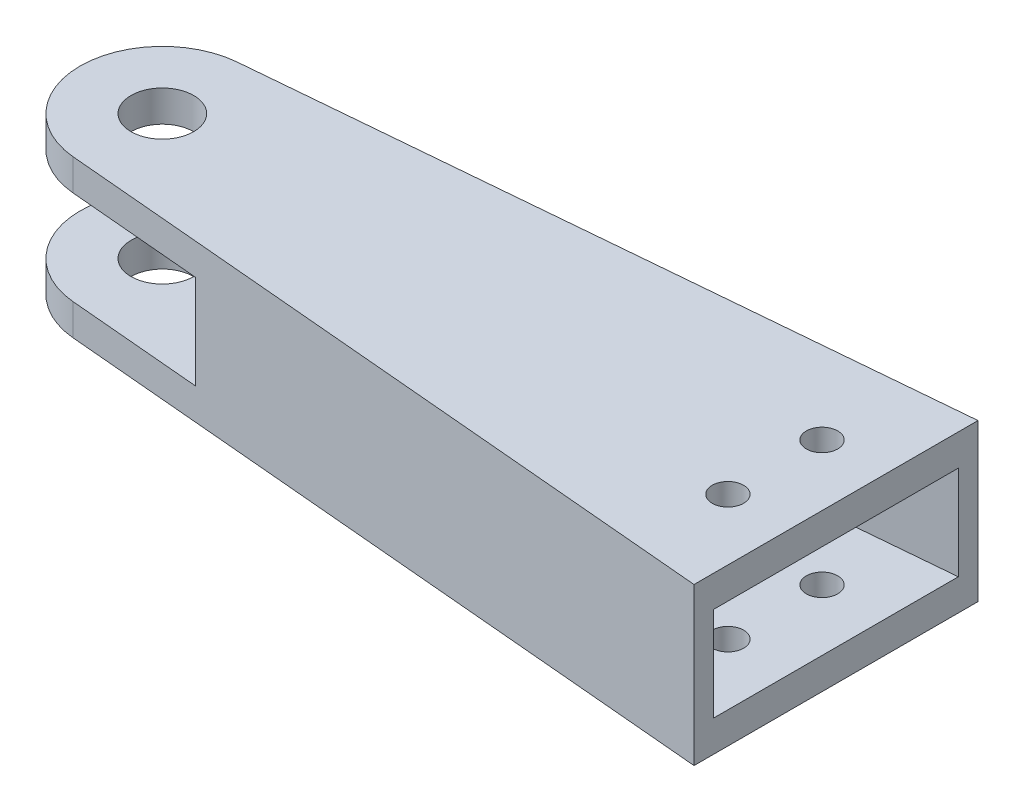
ISO-10303-21;
HEADER;
FILE_DESCRIPTION(('STEP AP214'),'2;1');
FILE_NAME('part.step','',(''),(''),'','','');
FILE_SCHEMA(('AUTOMOTIVE_DESIGN { 1 0 10303 214 1 1 1 1 }'));
ENDSEC;
DATA;
#1=APPLICATION_CONTEXT('core data for automotive mechanical design processes');
#2=APPLICATION_PROTOCOL_DEFINITION('international standard','automotive_design',2000,#1);
#3=PRODUCT_CONTEXT('',#1,'mechanical');
#4=PRODUCT('Part','Part','',(#3));
#5=PRODUCT_RELATED_PRODUCT_CATEGORY('part','',(#4));
#6=PRODUCT_DEFINITION_FORMATION('','',#4);
#7=PRODUCT_DEFINITION_CONTEXT('part definition',#1,'design');
#8=PRODUCT_DEFINITION('design','',#6,#7);
#9=PRODUCT_DEFINITION_SHAPE('','',#8);
#10=(LENGTH_UNIT() NAMED_UNIT(*) SI_UNIT(.MILLI.,.METRE.));
#11=(NAMED_UNIT(*) PLANE_ANGLE_UNIT() SI_UNIT($,.RADIAN.));
#12=(NAMED_UNIT(*) SI_UNIT($,.STERADIAN.) SOLID_ANGLE_UNIT());
#13=UNCERTAINTY_MEASURE_WITH_UNIT(LENGTH_MEASURE(1.E-05),#10,'distance_accuracy_value','');
#14=(GEOMETRIC_REPRESENTATION_CONTEXT(3) GLOBAL_UNCERTAINTY_ASSIGNED_CONTEXT((#13)) GLOBAL_UNIT_ASSIGNED_CONTEXT((#10,
#11,#12)) REPRESENTATION_CONTEXT('',''));
#15=CARTESIAN_POINT('',(0.,0.,0.));
#16=DIRECTION('',(0.,0.,1.));
#17=DIRECTION('',(1.,0.,0.));
#18=AXIS2_PLACEMENT_3D('',#15,#16,#17);
#19=CARTESIAN_POINT('',(0.,4.,0.));
#20=DIRECTION('',(0.,1.,0.));
#21=DIRECTION('',(0.,0.,1.));
#22=AXIS2_PLACEMENT_3D('',#19,#20,#21);
#23=PLANE('',#22);
#24=CARTESIAN_POINT('',(-160.9,4.,0.));
#25=DIRECTION('',(0.,1.,0.));
#26=DIRECTION('',(0.,0.,1.));
#27=AXIS2_PLACEMENT_3D('',#24,#25,#26);
#28=CIRCLE('',#27,3.99999999999999);
#29=CARTESIAN_POINT('',(-160.9,4.,3.99999999999999));
#30=VERTEX_POINT('',#29);
#31=EDGE_CURVE('E187',#30,#30,#28,.T.);
#32=ORIENTED_EDGE('',*,*,#31,.F.);
#33=EDGE_LOOP('',(#32));
#34=FACE_BOUND('',#33,.T.);
#35=DIRECTION('',(-0.0877327517225247,0.,0.996144047954509));
#36=VECTOR('',#35,1.);
#37=CARTESIAN_POINT('',(-142.570436415608,4.,-12.5565140169303));
#38=LINE('',#37,#36);
#39=CARTESIAN_POINT('',(-144.510751477509,4.,9.47440672955096));
#40=VERTEX_POINT('',#39);
#41=CARTESIAN_POINT('',(-144.730083356816,4.,11.9647668494372));
#42=VERTEX_POINT('',#41);
#43=EDGE_CURVE('E174',#40,#42,#38,.T.);
#44=ORIENTED_EDGE('',*,*,#43,.F.);
#45=DIRECTION('',(0.,0.,1.));
#46=VECTOR('',#45,1.);
#47=CARTESIAN_POINT('',(-144.510751477509,4.,-9.47440672955096));
#48=LINE('',#47,#46);
#49=CARTESIAN_POINT('',(-144.510751477509,4.,-9.47440672955096));
#50=VERTEX_POINT('',#49);
#51=EDGE_CURVE('E154',#50,#40,#48,.T.);
#52=ORIENTED_EDGE('',*,*,#51,.F.);
#53=DIRECTION('',(0.0877327517225137,0.,0.996144047954509));
#54=VECTOR('',#53,1.);
#55=CARTESIAN_POINT('',(-142.570436415608,4.,12.5565140169288));
#56=LINE('',#55,#54);
#57=CARTESIAN_POINT('',(-144.730083356816,4.,-11.9647668494372));
#58=VERTEX_POINT('',#57);
#59=EDGE_CURVE('E60',#58,#50,#56,.T.);
#60=ORIENTED_EDGE('',*,*,#59,.F.);
#61=DIRECTION('',(0.996144047954509,0.,-0.0877327517225177));
#62=VECTOR('',#61,1.);
#63=CARTESIAN_POINT('',(-2.15964694120755,4.,-24.5212808663666));
#64=LINE('',#63,#62);
#65=CARTESIAN_POINT('',(-161.821193893086,4.,-10.4595125035224));
#66=VERTEX_POINT('',#65);
#67=EDGE_CURVE('E178',#66,#58,#64,.T.);
#68=ORIENTED_EDGE('',*,*,#67,.F.);
#69=CARTESIAN_POINT('',(-160.9,4.,0.));
#70=DIRECTION('',(0.,1.,0.));
#71=DIRECTION('',(0.,0.,1.));
#72=AXIS2_PLACEMENT_3D('',#69,#70,#71);
#73=CIRCLE('',#72,10.5);
#74=CARTESIAN_POINT('',(-161.821193893086,4.,10.4595125035224));
#75=VERTEX_POINT('',#74);
#76=EDGE_CURVE('E180',#66,#75,#73,.T.);
#77=ORIENTED_EDGE('',*,*,#76,.T.);
#78=DIRECTION('',(0.996144047954509,0.,0.0877327517225177));
#79=VECTOR('',#78,1.);
#80=CARTESIAN_POINT('',(-2.15964694120755,4.,24.5212808663666));
#81=LINE('',#80,#79);
#82=EDGE_CURVE('E183',#75,#42,#81,.T.);
#83=ORIENTED_EDGE('',*,*,#82,.T.);
#84=EDGE_LOOP('',(#44,#52,#60,#68,#77,#83));
#85=FACE_BOUND('',#84,.T.);
#86=ADVANCED_FACE('F37',(#34,#85),#23,.T.);
#87=CARTESIAN_POINT('',(-82.8,4.,-6.01761447089224));
#88=DIRECTION('',(0.,1.,0.));
#89=DIRECTION('',(0.,0.,1.));
#90=AXIS2_PLACEMENT_3D('',#87,#88,#89);
#91=CIRCLE('',#90,2.);
#92=CARTESIAN_POINT('',(-82.8,4.,-4.01761447089224));
#93=VERTEX_POINT('',#92);
#94=EDGE_CURVE('E406',#93,#93,#91,.T.);
#95=ORIENTED_EDGE('',*,*,#94,.F.);
#96=EDGE_LOOP('',(#95));
#97=FACE_BOUND('',#96,.T.);
#98=CARTESIAN_POINT('',(-82.8,4.,5.98238552910776));
#99=DIRECTION('',(0.,1.,0.));
#100=DIRECTION('',(0.,0.,1.));
#101=AXIS2_PLACEMENT_3D('',#98,#99,#100);
#102=CIRCLE('',#101,2.);
#103=CARTESIAN_POINT('',(-82.8,4.,7.98238552910776));
#104=VERTEX_POINT('',#103);
#105=EDGE_CURVE('E275',#104,#104,#102,.T.);
#106=ORIENTED_EDGE('',*,*,#105,.F.);
#107=EDGE_LOOP('',(#106));
#108=FACE_BOUND('',#107,.T.);
#109=DIRECTION('',(-0.996144047954509,0.,0.0877327517225177));
#110=VECTOR('',#109,1.);
#111=CARTESIAN_POINT('',(-1.94031506190126,4.,-22.0309207464803));
#112=LINE('',#111,#110);
#113=CARTESIAN_POINT('',(-75.,4.,-15.5963822751002));
#114=VERTEX_POINT('',#113);
#115=CARTESIAN_POINT('',(-95.,4.,-13.8349351851403));
#116=VERTEX_POINT('',#115);
#117=EDGE_CURVE('E281',#114,#116,#112,.T.);
#118=ORIENTED_EDGE('',*,*,#117,.T.);
#119=DIRECTION('',(0.,0.,-1.));
#120=VECTOR('',#119,1.);
#121=CARTESIAN_POINT('',(-95.,4.,13.8349351851403));
#122=LINE('',#121,#120);
#123=CARTESIAN_POINT('',(-95.,4.,13.8349351851403));
#124=VERTEX_POINT('',#123);
#125=EDGE_CURVE('E52',#124,#116,#122,.T.);
#126=ORIENTED_EDGE('',*,*,#125,.F.);
#127=DIRECTION('',(0.996144047954509,0.,0.0877327517225177));
#128=VECTOR('',#127,1.);
#129=CARTESIAN_POINT('',(-1.94031506190126,4.,22.0309207464803));
#130=LINE('',#129,#128);
#131=CARTESIAN_POINT('',(-75.,4.,15.5963822751002));
#132=VERTEX_POINT('',#131);
#133=EDGE_CURVE('E153',#124,#132,#130,.T.);
#134=ORIENTED_EDGE('',*,*,#133,.T.);
#135=DIRECTION('',(0.,0.,-1.));
#136=VECTOR('',#135,1.);
#137=CARTESIAN_POINT('',(-75.,4.,0.));
#138=LINE('',#137,#136);
#139=EDGE_CURVE('E185',#132,#114,#138,.T.);
#140=ORIENTED_EDGE('',*,*,#139,.T.);
#141=EDGE_LOOP('',(#118,#126,#134,#140));
#142=FACE_BOUND('',#141,.T.);
#143=ADVANCED_FACE('F299',(#97,#108,#142),#23,.T.);
#144=CARTESIAN_POINT('',(-160.9,16.,0.));
#145=DIRECTION('',(0.,1.,0.));
#146=DIRECTION('',(0.,0.,1.));
#147=AXIS2_PLACEMENT_3D('',#144,#145,#146);
#148=PLANE('',#147);
#149=CARTESIAN_POINT('',(-160.9,16.,0.));
#150=DIRECTION('',(0.,1.,0.));
#151=DIRECTION('',(0.,0.,1.));
#152=AXIS2_PLACEMENT_3D('',#149,#150,#151);
#153=CIRCLE('',#152,3.99999999999999);
#154=CARTESIAN_POINT('',(-160.9,16.,3.99999999999999));
#155=VERTEX_POINT('',#154);
#156=EDGE_CURVE('E280',#155,#155,#153,.T.);
#157=ORIENTED_EDGE('',*,*,#156,.T.);
#158=EDGE_LOOP('',(#157));
#159=FACE_BOUND('',#158,.T.);
#160=DIRECTION('',(0.,0.,1.));
#161=VECTOR('',#160,1.);
#162=CARTESIAN_POINT('',(-144.510751477509,16.,-9.47440672955096));
#163=LINE('',#162,#161);
#164=CARTESIAN_POINT('',(-144.510751477509,16.,-9.47440672955096));
#165=VERTEX_POINT('',#164);
#166=CARTESIAN_POINT('',(-144.510751477509,16.,9.47440672955096));
#167=VERTEX_POINT('',#166);
#168=EDGE_CURVE('E145',#165,#167,#163,.T.);
#169=ORIENTED_EDGE('',*,*,#168,.T.);
#170=DIRECTION('',(-0.0877327517225247,0.,0.996144047954508));
#171=VECTOR('',#170,1.);
#172=CARTESIAN_POINT('',(-142.570436415608,16.,-12.5565140169303));
#173=LINE('',#172,#171);
#174=CARTESIAN_POINT('',(-144.730083356816,16.,11.9647668494372));
#175=VERTEX_POINT('',#174);
#176=EDGE_CURVE('E170',#167,#175,#173,.T.);
#177=ORIENTED_EDGE('',*,*,#176,.T.);
#178=DIRECTION('',(0.996144047954509,0.,0.0877327517225177));
#179=VECTOR('',#178,1.);
#180=CARTESIAN_POINT('',(-161.821193893086,16.,10.4595125035224));
#181=LINE('',#180,#179);
#182=CARTESIAN_POINT('',(-161.821193893086,16.,10.4595125035224));
#183=VERTEX_POINT('',#182);
#184=EDGE_CURVE('E249',#183,#175,#181,.T.);
#185=ORIENTED_EDGE('',*,*,#184,.F.);
#186=CARTESIAN_POINT('',(-160.9,16.,0.));
#187=DIRECTION('',(0.,1.,0.));
#188=DIRECTION('',(0.,0.,1.));
#189=AXIS2_PLACEMENT_3D('',#186,#187,#188);
#190=CIRCLE('',#189,10.5);
#191=CARTESIAN_POINT('',(-161.821193893086,16.,-10.4595125035224));
#192=VERTEX_POINT('',#191);
#193=EDGE_CURVE('E247',#192,#183,#190,.T.);
#194=ORIENTED_EDGE('',*,*,#193,.F.);
#195=DIRECTION('',(-0.996144047954509,0.,0.0877327517225177));
#196=VECTOR('',#195,1.);
#197=CARTESIAN_POINT('',(-75.,16.,-18.1060594700135));
#198=LINE('',#197,#196);
#199=CARTESIAN_POINT('',(-144.730083356816,16.,-11.9647668494372));
#200=VERTEX_POINT('',#199);
#201=EDGE_CURVE('E244',#200,#192,#198,.T.);
#202=ORIENTED_EDGE('',*,*,#201,.F.);
#203=DIRECTION('',(0.0877327517225137,0.,0.996144047954509));
#204=VECTOR('',#203,1.);
#205=CARTESIAN_POINT('',(-142.570436415608,16.,12.5565140169288));
#206=LINE('',#205,#204);
#207=EDGE_CURVE('E270',#200,#165,#206,.T.);
#208=ORIENTED_EDGE('',*,*,#207,.T.);
#209=EDGE_LOOP('',(#169,#177,#185,#194,#202,#208));
#210=FACE_BOUND('',#209,.T.);
#211=ADVANCED_FACE('F259',(#159,#210),#148,.F.);
#212=CARTESIAN_POINT('',(-82.8,16.,-6.01761447089224));
#213=DIRECTION('',(0.,1.,0.));
#214=DIRECTION('',(0.,0.,1.));
#215=AXIS2_PLACEMENT_3D('',#212,#213,#214);
#216=CIRCLE('',#215,2.);
#217=CARTESIAN_POINT('',(-82.8,16.,-4.01761447089224));
#218=VERTEX_POINT('',#217);
#219=EDGE_CURVE('E410',#218,#218,#216,.T.);
#220=ORIENTED_EDGE('',*,*,#219,.T.);
#221=EDGE_LOOP('',(#220));
#222=FACE_BOUND('',#221,.T.);
#223=CARTESIAN_POINT('',(-82.8,16.,5.98238552910776));
#224=DIRECTION('',(0.,1.,0.));
#225=DIRECTION('',(0.,0.,1.));
#226=AXIS2_PLACEMENT_3D('',#223,#224,#225);
#227=CIRCLE('',#226,2.);
#228=CARTESIAN_POINT('',(-82.8,16.,7.98238552910776));
#229=VERTEX_POINT('',#228);
#230=EDGE_CURVE('E404',#229,#229,#227,.T.);
#231=ORIENTED_EDGE('',*,*,#230,.T.);
#232=EDGE_LOOP('',(#231));
#233=FACE_BOUND('',#232,.T.);
#234=DIRECTION('',(0.,0.,-1.));
#235=VECTOR('',#234,1.);
#236=CARTESIAN_POINT('',(-95.,16.,13.8349351851403));
#237=LINE('',#236,#235);
#238=CARTESIAN_POINT('',(-95.,16.,13.8349351851403));
#239=VERTEX_POINT('',#238);
#240=CARTESIAN_POINT('',(-95.,16.,-13.8349351851403));
#241=VERTEX_POINT('',#240);
#242=EDGE_CURVE('E136',#239,#241,#237,.T.);
#243=ORIENTED_EDGE('',*,*,#242,.T.);
#244=DIRECTION('',(-0.996144047954509,0.,0.0877327517225177));
#245=VECTOR('',#244,1.);
#246=CARTESIAN_POINT('',(-1.94031506190126,16.,-22.0309207464803));
#247=LINE('',#246,#245);
#248=CARTESIAN_POINT('',(-75.,16.,-15.5963822751002));
#249=VERTEX_POINT('',#248);
#250=EDGE_CURVE('E289',#249,#241,#247,.T.);
#251=ORIENTED_EDGE('',*,*,#250,.F.);
#252=DIRECTION('',(0.,0.,-1.));
#253=VECTOR('',#252,1.);
#254=CARTESIAN_POINT('',(-75.,16.,18.1060594700135));
#255=LINE('',#254,#253);
#256=CARTESIAN_POINT('',(-75.,16.,15.5963822751002));
#257=VERTEX_POINT('',#256);
#258=EDGE_CURVE('E159',#257,#249,#255,.T.);
#259=ORIENTED_EDGE('',*,*,#258,.F.);
#260=DIRECTION('',(0.996144047954509,0.,0.0877327517225177));
#261=VECTOR('',#260,1.);
#262=CARTESIAN_POINT('',(-1.94031506190126,16.,22.0309207464803));
#263=LINE('',#262,#261);
#264=EDGE_CURVE('E151',#239,#257,#263,.T.);
#265=ORIENTED_EDGE('',*,*,#264,.F.);
#266=EDGE_LOOP('',(#243,#251,#259,#265));
#267=FACE_BOUND('',#266,.T.);
#268=ADVANCED_FACE('F157',(#222,#233,#267),#148,.F.);
#269=CARTESIAN_POINT('',(-1.94031506190126,86.2622939703821,22.0309207464803));
#270=DIRECTION('',(0.0877327517225177,0.,-0.996144047954509));
#271=DIRECTION('',(-0.996144047954509,0.,-0.0877327517225177));
#272=AXIS2_PLACEMENT_3D('',#269,#270,#271);
#273=PLANE('',#272);
#274=ORIENTED_EDGE('',*,*,#133,.F.);
#275=DIRECTION('',(0.,-1.,0.));
#276=VECTOR('',#275,1.);
#277=CARTESIAN_POINT('',(-95.,72.7180415580072,13.8349351851403));
#278=LINE('',#277,#276);
#279=EDGE_CURVE('E139',#239,#124,#278,.T.);
#280=ORIENTED_EDGE('',*,*,#279,.F.);
#281=ORIENTED_EDGE('',*,*,#264,.T.);
#282=DIRECTION('',(0.,-1.,0.));
#283=VECTOR('',#282,1.);
#284=CARTESIAN_POINT('',(-75.,86.2622939703821,15.5963822751002));
#285=LINE('',#284,#283);
#286=EDGE_CURVE('E160',#257,#132,#285,.T.);
#287=ORIENTED_EDGE('',*,*,#286,.T.);
#288=EDGE_LOOP('',(#274,#280,#281,#287));
#289=FACE_BOUND('',#288,.T.);
#290=ADVANCED_FACE('F149',(#289),#273,.T.);
#291=CARTESIAN_POINT('',(-1.94031506190126,86.2622939703821,-22.0309207464803));
#292=DIRECTION('',(0.0877327517225177,0.,0.996144047954509));
#293=DIRECTION('',(0.996144047954509,0.,-0.0877327517225177));
#294=AXIS2_PLACEMENT_3D('',#291,#292,#293);
#295=PLANE('',#294);
#296=ORIENTED_EDGE('',*,*,#250,.T.);
#297=DIRECTION('',(0.,-1.,0.));
#298=VECTOR('',#297,1.);
#299=CARTESIAN_POINT('',(-95.,72.7180415580072,-13.8349351851403));
#300=LINE('',#299,#298);
#301=EDGE_CURVE('E140',#241,#116,#300,.T.);
#302=ORIENTED_EDGE('',*,*,#301,.T.);
#303=ORIENTED_EDGE('',*,*,#117,.F.);
#304=DIRECTION('',(0.,-1.,0.));
#305=VECTOR('',#304,1.);
#306=CARTESIAN_POINT('',(-75.,86.2622939703821,-15.5963822751002));
#307=LINE('',#306,#305);
#308=EDGE_CURVE('E286',#249,#114,#307,.T.);
#309=ORIENTED_EDGE('',*,*,#308,.F.);
#310=EDGE_LOOP('',(#296,#302,#303,#309));
#311=FACE_BOUND('',#310,.T.);
#312=ADVANCED_FACE('F326',(#311),#295,.T.);
#313=CARTESIAN_POINT('',(-2.15964694120755,4.,-24.5212808663666));
#314=DIRECTION('',(-0.0877327517225177,0.,-0.996144047954509));
#315=DIRECTION('',(-0.996144047954509,0.,0.0877327517225177));
#316=AXIS2_PLACEMENT_3D('',#313,#314,#315);
#317=PLANE('',#316);
#318=DIRECTION('',(0.996144047954509,0.,-0.0877327517225177));
#319=VECTOR('',#318,1.);
#320=CARTESIAN_POINT('',(-2.15964694120755,0.,-24.5212808663666));
#321=LINE('',#320,#319);
#322=CARTESIAN_POINT('',(-161.821193893086,0.,-10.4595125035224));
#323=VERTEX_POINT('',#322);
#324=CARTESIAN_POINT('',(-75.,0.,-18.1060594700135));
#325=VERTEX_POINT('',#324);
#326=EDGE_CURVE('E191',#323,#325,#321,.T.);
#327=ORIENTED_EDGE('',*,*,#326,.F.);
#328=DIRECTION('',(0.,-1.,0.));
#329=VECTOR('',#328,1.);
#330=CARTESIAN_POINT('',(-161.821193893086,4.,-10.4595125035224));
#331=LINE('',#330,#329);
#332=EDGE_CURVE('E11',#66,#323,#331,.T.);
#333=ORIENTED_EDGE('',*,*,#332,.F.);
#334=ORIENTED_EDGE('',*,*,#67,.T.);
#335=DIRECTION('',(0.,-1.,0.));
#336=VECTOR('',#335,1.);
#337=CARTESIAN_POINT('',(-144.730083356816,86.2622939703821,-11.9647668494372));
#338=LINE('',#337,#336);
#339=EDGE_CURVE('E273',#200,#58,#338,.T.);
#340=ORIENTED_EDGE('',*,*,#339,.F.);
#341=ORIENTED_EDGE('',*,*,#201,.T.);
#342=DIRECTION('',(0.,-1.,0.));
#343=VECTOR('',#342,1.);
#344=CARTESIAN_POINT('',(-161.821193893086,20.,-10.4595125035224));
#345=LINE('',#344,#343);
#346=CARTESIAN_POINT('',(-161.821193893086,20.,-10.4595125035224));
#347=VERTEX_POINT('',#346);
#348=EDGE_CURVE('E161',#347,#192,#345,.T.);
#349=ORIENTED_EDGE('',*,*,#348,.F.);
#350=DIRECTION('',(-0.996144047954509,0.,0.0877327517225177));
#351=VECTOR('',#350,1.);
#352=CARTESIAN_POINT('',(-75.,20.,-18.1060594700135));
#353=LINE('',#352,#351);
#354=CARTESIAN_POINT('',(-75.,20.,-18.1060594700135));
#355=VERTEX_POINT('',#354);
#356=EDGE_CURVE('E239',#355,#347,#353,.T.);
#357=ORIENTED_EDGE('',*,*,#356,.F.);
#358=DIRECTION('',(0.,-1.,0.));
#359=VECTOR('',#358,1.);
#360=CARTESIAN_POINT('',(-75.,4.,-18.1060594700135));
#361=LINE('',#360,#359);
#362=EDGE_CURVE('E190',#355,#325,#361,.T.);
#363=ORIENTED_EDGE('',*,*,#362,.T.);
#364=EDGE_LOOP('',(#327,#333,#334,#340,#341,#349,#357,#363));
#365=FACE_BOUND('',#364,.T.);
#366=ADVANCED_FACE('F39',(#365),#317,.T.);
#367=CARTESIAN_POINT('',(-160.9,4.,0.));
#368=DIRECTION('',(0.,-1.,0.));
#369=DIRECTION('',(0.,0.,-1.));
#370=AXIS2_PLACEMENT_3D('',#367,#368,#369);
#371=CYLINDRICAL_SURFACE('',#370,10.5);
#372=CARTESIAN_POINT('',(-160.9,0.,0.));
#373=DIRECTION('',(0.,1.,0.));
#374=DIRECTION('',(0.,0.,1.));
#375=AXIS2_PLACEMENT_3D('',#372,#373,#374);
#376=CIRCLE('',#375,10.5);
#377=CARTESIAN_POINT('',(-161.821193893086,0.,10.4595125035224));
#378=VERTEX_POINT('',#377);
#379=EDGE_CURVE('E194',#323,#378,#376,.T.);
#380=ORIENTED_EDGE('',*,*,#379,.T.);
#381=DIRECTION('',(0.,-1.,0.));
#382=VECTOR('',#381,1.);
#383=CARTESIAN_POINT('',(-161.821193893086,4.,10.4595125035224));
#384=LINE('',#383,#382);
#385=EDGE_CURVE('E45',#75,#378,#384,.T.);
#386=ORIENTED_EDGE('',*,*,#385,.F.);
#387=ORIENTED_EDGE('',*,*,#76,.F.);
#388=ORIENTED_EDGE('',*,*,#332,.T.);
#389=EDGE_LOOP('',(#380,#386,#387,#388));
#390=FACE_BOUND('',#389,.T.);
#391=ADVANCED_FACE('F297',(#390),#371,.T.);
#392=CARTESIAN_POINT('',(-2.15964694120755,4.,24.5212808663666));
#393=DIRECTION('',(0.0877327517225177,0.,-0.996144047954509));
#394=DIRECTION('',(-0.996144047954509,0.,-0.0877327517225177));
#395=AXIS2_PLACEMENT_3D('',#392,#393,#394);
#396=PLANE('',#395);
#397=DIRECTION('',(0.996144047954509,0.,0.0877327517225177));
#398=VECTOR('',#397,1.);
#399=CARTESIAN_POINT('',(-2.15964694120755,0.,24.5212808663666));
#400=LINE('',#399,#398);
#401=CARTESIAN_POINT('',(-75.,0.,18.1060594700135));
#402=VERTEX_POINT('',#401);
#403=EDGE_CURVE('E196',#378,#402,#400,.T.);
#404=ORIENTED_EDGE('',*,*,#403,.T.);
#405=DIRECTION('',(0.,-1.,0.));
#406=VECTOR('',#405,1.);
#407=CARTESIAN_POINT('',(-75.,4.,18.1060594700135));
#408=LINE('',#407,#406);
#409=CARTESIAN_POINT('',(-75.,20.,18.1060594700135));
#410=VERTEX_POINT('',#409);
#411=EDGE_CURVE('E204',#410,#402,#408,.T.);
#412=ORIENTED_EDGE('',*,*,#411,.F.);
#413=DIRECTION('',(0.996144047954509,0.,0.0877327517225177));
#414=VECTOR('',#413,1.);
#415=CARTESIAN_POINT('',(-161.821193893086,20.,10.4595125035224));
#416=LINE('',#415,#414);
#417=CARTESIAN_POINT('',(-161.821193893086,20.,10.4595125035224));
#418=VERTEX_POINT('',#417);
#419=EDGE_CURVE('E230',#418,#410,#416,.T.);
#420=ORIENTED_EDGE('',*,*,#419,.F.);
#421=DIRECTION('',(0.,-1.,0.));
#422=VECTOR('',#421,1.);
#423=CARTESIAN_POINT('',(-161.821193893086,20.,10.4595125035224));
#424=LINE('',#423,#422);
#425=EDGE_CURVE('E166',#418,#183,#424,.T.);
#426=ORIENTED_EDGE('',*,*,#425,.T.);
#427=ORIENTED_EDGE('',*,*,#184,.T.);
#428=DIRECTION('',(0.,-1.,0.));
#429=VECTOR('',#428,1.);
#430=CARTESIAN_POINT('',(-144.730083356816,86.2622939703821,11.9647668494372));
#431=LINE('',#430,#429);
#432=EDGE_CURVE('E175',#175,#42,#431,.T.);
#433=ORIENTED_EDGE('',*,*,#432,.T.);
#434=ORIENTED_EDGE('',*,*,#82,.F.);
#435=ORIENTED_EDGE('',*,*,#385,.T.);
#436=EDGE_LOOP('',(#404,#412,#420,#426,#427,#433,#434,#435));
#437=FACE_BOUND('',#436,.T.);
#438=ADVANCED_FACE('F211',(#437),#396,.F.);
#439=CARTESIAN_POINT('',(-75.,4.,0.));
#440=DIRECTION('',(-1.,0.,0.));
#441=DIRECTION('',(0.,0.,1.));
#442=AXIS2_PLACEMENT_3D('',#439,#440,#441);
#443=PLANE('',#442);
#444=ORIENTED_EDGE('',*,*,#362,.F.);
#445=DIRECTION('',(0.,0.,-1.));
#446=VECTOR('',#445,1.);
#447=CARTESIAN_POINT('',(-75.,20.,18.1060594700135));
#448=LINE('',#447,#446);
#449=EDGE_CURVE('E226',#410,#355,#448,.T.);
#450=ORIENTED_EDGE('',*,*,#449,.F.);
#451=ORIENTED_EDGE('',*,*,#411,.T.);
#452=DIRECTION('',(0.,0.,-1.));
#453=VECTOR('',#452,1.);
#454=CARTESIAN_POINT('',(-75.,0.,0.));
#455=LINE('',#454,#453);
#456=EDGE_CURVE('E198',#402,#325,#455,.T.);
#457=ORIENTED_EDGE('',*,*,#456,.T.);
#458=EDGE_LOOP('',(#444,#450,#451,#457));
#459=FACE_BOUND('',#458,.T.);
#460=ORIENTED_EDGE('',*,*,#308,.T.);
#461=ORIENTED_EDGE('',*,*,#139,.F.);
#462=ORIENTED_EDGE('',*,*,#286,.F.);
#463=ORIENTED_EDGE('',*,*,#258,.T.);
#464=EDGE_LOOP('',(#460,#461,#462,#463));
#465=FACE_BOUND('',#464,.T.);
#466=ADVANCED_FACE('F221',(#459,#465),#443,.F.);
#467=CARTESIAN_POINT('',(-160.9,4.,0.));
#468=DIRECTION('',(0.,-1.,0.));
#469=DIRECTION('',(0.,0.,-1.));
#470=AXIS2_PLACEMENT_3D('',#467,#468,#469);
#471=CYLINDRICAL_SURFACE('',#470,3.99999999999999);
#472=ORIENTED_EDGE('',*,*,#31,.T.);
#473=EDGE_LOOP('',(#472));
#474=FACE_BOUND('',#473,.T.);
#475=CARTESIAN_POINT('',(-160.9,0.,0.));
#476=DIRECTION('',(0.,1.,0.));
#477=DIRECTION('',(0.,0.,1.));
#478=AXIS2_PLACEMENT_3D('',#475,#476,#477);
#479=CIRCLE('',#478,3.99999999999999);
#480=CARTESIAN_POINT('',(-160.9,0.,3.99999999999999));
#481=VERTEX_POINT('',#480);
#482=EDGE_CURVE('E181',#481,#481,#479,.T.);
#483=ORIENTED_EDGE('',*,*,#482,.F.);
#484=EDGE_LOOP('',(#483));
#485=FACE_BOUND('',#484,.T.);
#486=ADVANCED_FACE('F314',(#474,#485),#471,.F.);
#487=CARTESIAN_POINT('',(0.,0.,0.));
#488=DIRECTION('',(0.,1.,0.));
#489=DIRECTION('',(0.,0.,1.));
#490=AXIS2_PLACEMENT_3D('',#487,#488,#489);
#491=PLANE('',#490);
#492=CARTESIAN_POINT('',(-82.8,0.,5.98238552910776));
#493=DIRECTION('',(0.,-1.,0.));
#494=DIRECTION('',(0.,0.,-1.));
#495=AXIS2_PLACEMENT_3D('',#492,#493,#494);
#496=CIRCLE('',#495,2.);
#497=CARTESIAN_POINT('',(-82.8,0.,3.98238552910776));
#498=VERTEX_POINT('',#497);
#499=EDGE_CURVE('E422',#498,#498,#496,.T.);
#500=ORIENTED_EDGE('',*,*,#499,.F.);
#501=EDGE_LOOP('',(#500));
#502=FACE_BOUND('',#501,.T.);
#503=CARTESIAN_POINT('',(-82.8,0.,-6.01761447089224));
#504=DIRECTION('',(0.,-1.,0.));
#505=DIRECTION('',(0.,0.,-1.));
#506=AXIS2_PLACEMENT_3D('',#503,#504,#505);
#507=CIRCLE('',#506,2.);
#508=CARTESIAN_POINT('',(-82.8,0.,-8.01761447089224));
#509=VERTEX_POINT('',#508);
#510=EDGE_CURVE('E418',#509,#509,#507,.T.);
#511=ORIENTED_EDGE('',*,*,#510,.F.);
#512=EDGE_LOOP('',(#511));
#513=FACE_BOUND('',#512,.T.);
#514=ORIENTED_EDGE('',*,*,#326,.T.);
#515=ORIENTED_EDGE('',*,*,#456,.F.);
#516=ORIENTED_EDGE('',*,*,#403,.F.);
#517=ORIENTED_EDGE('',*,*,#379,.F.);
#518=EDGE_LOOP('',(#514,#515,#516,#517));
#519=FACE_BOUND('',#518,.T.);
#520=ORIENTED_EDGE('',*,*,#482,.T.);
#521=EDGE_LOOP('',(#520));
#522=FACE_BOUND('',#521,.T.);
#523=ADVANCED_FACE('F217',(#502,#513,#519,#522),#491,.F.);
#524=CARTESIAN_POINT('',(-142.570436415608,86.2622939703821,-12.5565140169303));
#525=DIRECTION('',(0.996144047954508,0.,0.0877327517225247));
#526=DIRECTION('',(0.0877327517225247,0.,-0.996144047954508));
#527=AXIS2_PLACEMENT_3D('',#524,#525,#526);
#528=PLANE('',#527);
#529=ORIENTED_EDGE('',*,*,#176,.F.);
#530=DIRECTION('',(0.,-1.,0.));
#531=VECTOR('',#530,1.);
#532=CARTESIAN_POINT('',(-144.510751477509,86.2622939703821,9.47440672955096));
#533=LINE('',#532,#531);
#534=EDGE_CURVE('E163',#167,#40,#533,.T.);
#535=ORIENTED_EDGE('',*,*,#534,.T.);
#536=ORIENTED_EDGE('',*,*,#43,.T.);
#537=ORIENTED_EDGE('',*,*,#432,.F.);
#538=EDGE_LOOP('',(#529,#535,#536,#537));
#539=FACE_BOUND('',#538,.T.);
#540=ADVANCED_FACE('F313',(#539),#528,.F.);
#541=CARTESIAN_POINT('',(-160.9,20.,0.));
#542=DIRECTION('',(0.,1.,0.));
#543=DIRECTION('',(0.,0.,1.));
#544=AXIS2_PLACEMENT_3D('',#541,#542,#543);
#545=PLANE('',#544);
#546=CARTESIAN_POINT('',(-82.8,20.,5.98238552910776));
#547=DIRECTION('',(0.,-1.,0.));
#548=DIRECTION('',(0.,0.,-1.));
#549=AXIS2_PLACEMENT_3D('',#546,#547,#548);
#550=CIRCLE('',#549,2.);
#551=CARTESIAN_POINT('',(-82.8,20.,3.98238552910776));
#552=VERTEX_POINT('',#551);
#553=EDGE_CURVE('E401',#552,#552,#550,.T.);
#554=ORIENTED_EDGE('',*,*,#553,.T.);
#555=EDGE_LOOP('',(#554));
#556=FACE_BOUND('',#555,.T.);
#557=CARTESIAN_POINT('',(-82.8,20.,-6.01761447089224));
#558=DIRECTION('',(0.,-1.,0.));
#559=DIRECTION('',(0.,0.,-1.));
#560=AXIS2_PLACEMENT_3D('',#557,#558,#559);
#561=CIRCLE('',#560,2.);
#562=CARTESIAN_POINT('',(-82.8,20.,-8.01761447089224));
#563=VERTEX_POINT('',#562);
#564=EDGE_CURVE('E425',#563,#563,#561,.T.);
#565=ORIENTED_EDGE('',*,*,#564,.T.);
#566=EDGE_LOOP('',(#565));
#567=FACE_BOUND('',#566,.T.);
#568=ORIENTED_EDGE('',*,*,#449,.T.);
#569=ORIENTED_EDGE('',*,*,#356,.T.);
#570=CARTESIAN_POINT('',(-160.9,20.,0.));
#571=DIRECTION('',(0.,1.,0.));
#572=DIRECTION('',(0.,0.,1.));
#573=AXIS2_PLACEMENT_3D('',#570,#571,#572);
#574=CIRCLE('',#573,10.5);
#575=EDGE_CURVE('E235',#347,#418,#574,.T.);
#576=ORIENTED_EDGE('',*,*,#575,.T.);
#577=ORIENTED_EDGE('',*,*,#419,.T.);
#578=EDGE_LOOP('',(#568,#569,#576,#577));
#579=FACE_BOUND('',#578,.T.);
#580=CARTESIAN_POINT('',(-160.9,20.,0.));
#581=DIRECTION('',(0.,1.,0.));
#582=DIRECTION('',(0.,0.,1.));
#583=AXIS2_PLACEMENT_3D('',#580,#581,#582);
#584=CIRCLE('',#583,3.99999999999999);
#585=CARTESIAN_POINT('',(-160.9,20.,3.99999999999999));
#586=VERTEX_POINT('',#585);
#587=EDGE_CURVE('E245',#586,#586,#584,.T.);
#588=ORIENTED_EDGE('',*,*,#587,.F.);
#589=EDGE_LOOP('',(#588));
#590=FACE_BOUND('',#589,.T.);
#591=ADVANCED_FACE('F232',(#556,#567,#579,#590),#545,.T.);
#592=CARTESIAN_POINT('',(-160.9,20.,0.));
#593=DIRECTION('',(0.,-1.,0.));
#594=DIRECTION('',(0.,0.,-1.));
#595=AXIS2_PLACEMENT_3D('',#592,#593,#594);
#596=CYLINDRICAL_SURFACE('',#595,10.5);
#597=ORIENTED_EDGE('',*,*,#193,.T.);
#598=ORIENTED_EDGE('',*,*,#425,.F.);
#599=ORIENTED_EDGE('',*,*,#575,.F.);
#600=ORIENTED_EDGE('',*,*,#348,.T.);
#601=EDGE_LOOP('',(#597,#598,#599,#600));
#602=FACE_BOUND('',#601,.T.);
#603=ADVANCED_FACE('F266',(#602),#596,.T.);
#604=CARTESIAN_POINT('',(-160.9,20.,0.));
#605=DIRECTION('',(0.,-1.,0.));
#606=DIRECTION('',(0.,0.,-1.));
#607=AXIS2_PLACEMENT_3D('',#604,#605,#606);
#608=CYLINDRICAL_SURFACE('',#607,3.99999999999999);
#609=ORIENTED_EDGE('',*,*,#587,.T.);
#610=EDGE_LOOP('',(#609));
#611=FACE_BOUND('',#610,.T.);
#612=ORIENTED_EDGE('',*,*,#156,.F.);
#613=EDGE_LOOP('',(#612));
#614=FACE_BOUND('',#613,.T.);
#615=ADVANCED_FACE('F343',(#611,#614),#608,.F.);
#616=CARTESIAN_POINT('',(-142.570436415608,86.2622939703821,12.5565140169288));
#617=DIRECTION('',(0.996144047954509,0.,-0.0877327517225136));
#618=DIRECTION('',(-0.0877327517225137,0.,-0.996144047954509));
#619=AXIS2_PLACEMENT_3D('',#616,#617,#618);
#620=PLANE('',#619);
#621=ORIENTED_EDGE('',*,*,#207,.F.);
#622=ORIENTED_EDGE('',*,*,#339,.T.);
#623=ORIENTED_EDGE('',*,*,#59,.T.);
#624=DIRECTION('',(0.,-1.,0.));
#625=VECTOR('',#624,1.);
#626=CARTESIAN_POINT('',(-144.510751477509,86.2622939703821,-9.47440672955096));
#627=LINE('',#626,#625);
#628=EDGE_CURVE('E279',#165,#50,#627,.T.);
#629=ORIENTED_EDGE('',*,*,#628,.F.);
#630=EDGE_LOOP('',(#621,#622,#623,#629));
#631=FACE_BOUND('',#630,.T.);
#632=ADVANCED_FACE('F277',(#631),#620,.F.);
#633=CARTESIAN_POINT('',(-82.8,20.,-6.01761447089224));
#634=DIRECTION('',(0.,-1.,0.));
#635=DIRECTION('',(0.,0.,-1.));
#636=AXIS2_PLACEMENT_3D('',#633,#634,#635);
#637=CYLINDRICAL_SURFACE('',#636,2.);
#638=ORIENTED_EDGE('',*,*,#564,.F.);
#639=EDGE_LOOP('',(#638));
#640=FACE_BOUND('',#639,.T.);
#641=ORIENTED_EDGE('',*,*,#219,.F.);
#642=EDGE_LOOP('',(#641));
#643=FACE_BOUND('',#642,.T.);
#644=ADVANCED_FACE('F342',(#640,#643),#637,.F.);
#645=CARTESIAN_POINT('',(-82.8,20.,5.98238552910776));
#646=DIRECTION('',(0.,-1.,0.));
#647=DIRECTION('',(0.,0.,-1.));
#648=AXIS2_PLACEMENT_3D('',#645,#646,#647);
#649=CYLINDRICAL_SURFACE('',#648,2.);
#650=ORIENTED_EDGE('',*,*,#553,.F.);
#651=EDGE_LOOP('',(#650));
#652=FACE_BOUND('',#651,.T.);
#653=ORIENTED_EDGE('',*,*,#230,.F.);
#654=EDGE_LOOP('',(#653));
#655=FACE_BOUND('',#654,.T.);
#656=ADVANCED_FACE('F386',(#652,#655),#649,.F.);
#657=ORIENTED_EDGE('',*,*,#94,.T.);
#658=EDGE_LOOP('',(#657));
#659=FACE_BOUND('',#658,.T.);
#660=ORIENTED_EDGE('',*,*,#510,.T.);
#661=EDGE_LOOP('',(#660));
#662=FACE_BOUND('',#661,.T.);
#663=ADVANCED_FACE('F338',(#659,#662),#637,.F.);
#664=ORIENTED_EDGE('',*,*,#105,.T.);
#665=EDGE_LOOP('',(#664));
#666=FACE_BOUND('',#665,.T.);
#667=ORIENTED_EDGE('',*,*,#499,.T.);
#668=EDGE_LOOP('',(#667));
#669=FACE_BOUND('',#668,.T.);
#670=ADVANCED_FACE('F371',(#666,#669),#649,.F.);
#671=CARTESIAN_POINT('',(-95.,72.7180415580072,13.8349351851403));
#672=DIRECTION('',(-1.,0.,0.));
#673=DIRECTION('',(0.,0.,1.));
#674=AXIS2_PLACEMENT_3D('',#671,#672,#673);
#675=PLANE('',#674);
#676=ORIENTED_EDGE('',*,*,#242,.F.);
#677=ORIENTED_EDGE('',*,*,#279,.T.);
#678=ORIENTED_EDGE('',*,*,#125,.T.);
#679=ORIENTED_EDGE('',*,*,#301,.F.);
#680=EDGE_LOOP('',(#676,#677,#678,#679));
#681=FACE_BOUND('',#680,.T.);
#682=ADVANCED_FACE('F138',(#681),#675,.F.);
#683=CARTESIAN_POINT('',(-144.510751477509,72.7180415580072,-9.47440672955096));
#684=DIRECTION('',(1.,0.,0.));
#685=DIRECTION('',(0.,0.,-1.));
#686=AXIS2_PLACEMENT_3D('',#683,#684,#685);
#687=PLANE('',#686);
#688=ORIENTED_EDGE('',*,*,#168,.F.);
#689=ORIENTED_EDGE('',*,*,#628,.T.);
#690=ORIENTED_EDGE('',*,*,#51,.T.);
#691=ORIENTED_EDGE('',*,*,#534,.F.);
#692=EDGE_LOOP('',(#688,#689,#690,#691));
#693=FACE_BOUND('',#692,.T.);
#694=ADVANCED_FACE('F370',(#693),#687,.F.);
#695=CLOSED_SHELL('',(#86,#143,#211,#268,#290,#312,#366,#391,#438,#466,#486,#523,#540,#591,#603,
#615,#632,#644,#656,#663,#670,#682,#694));
#696=MANIFOLD_SOLID_BREP('B2',#695);
#697=ADVANCED_BREP_SHAPE_REPRESENTATION('',(#18,#696),#14);
#698=SHAPE_DEFINITION_REPRESENTATION(#9,#697);
ENDSEC;
END-ISO-10303-21;
